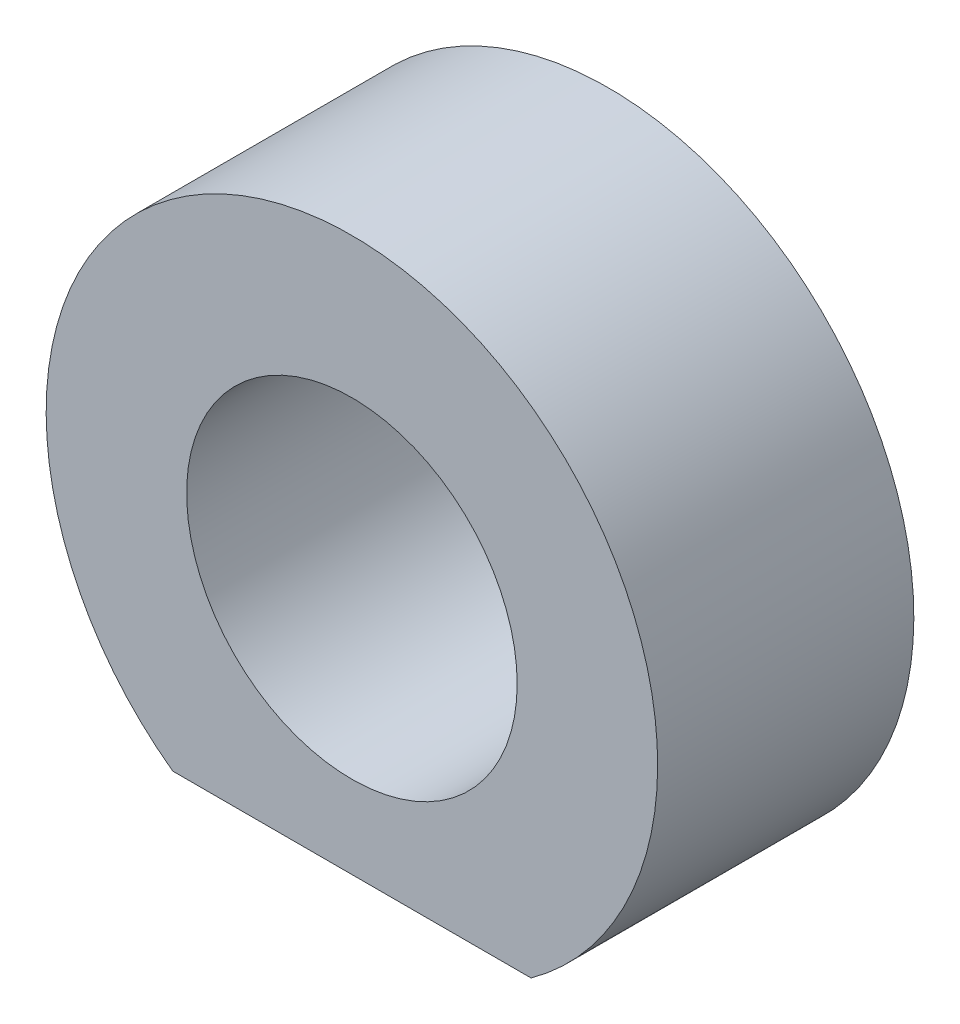
ISO-10303-21;
HEADER;
FILE_DESCRIPTION(('STEP AP214'),'2;1');
FILE_NAME('part.step','',(''),(''),'','','');
FILE_SCHEMA(('AUTOMOTIVE_DESIGN { 1 0 10303 214 1 1 1 1 }'));
ENDSEC;
DATA;
#1=APPLICATION_CONTEXT('core data for automotive mechanical design processes');
#2=APPLICATION_PROTOCOL_DEFINITION('international standard','automotive_design',2000,#1);
#3=PRODUCT_CONTEXT('',#1,'mechanical');
#4=PRODUCT('Part','Part','',(#3));
#5=PRODUCT_RELATED_PRODUCT_CATEGORY('part','',(#4));
#6=PRODUCT_DEFINITION_FORMATION('','',#4);
#7=PRODUCT_DEFINITION_CONTEXT('part definition',#1,'design');
#8=PRODUCT_DEFINITION('design','',#6,#7);
#9=PRODUCT_DEFINITION_SHAPE('','',#8);
#10=(LENGTH_UNIT() NAMED_UNIT(*) SI_UNIT(.MILLI.,.METRE.));
#11=(NAMED_UNIT(*) PLANE_ANGLE_UNIT() SI_UNIT($,.RADIAN.));
#12=(NAMED_UNIT(*) SI_UNIT($,.STERADIAN.) SOLID_ANGLE_UNIT());
#13=UNCERTAINTY_MEASURE_WITH_UNIT(LENGTH_MEASURE(1.E-05),#10,'distance_accuracy_value','');
#14=(GEOMETRIC_REPRESENTATION_CONTEXT(3) GLOBAL_UNCERTAINTY_ASSIGNED_CONTEXT((#13)) GLOBAL_UNIT_ASSIGNED_CONTEXT((#10,
#11,#12)) REPRESENTATION_CONTEXT('',''));
#15=CARTESIAN_POINT('',(0.,0.,0.));
#16=DIRECTION('',(0.,0.,1.));
#17=DIRECTION('',(1.,0.,0.));
#18=AXIS2_PLACEMENT_3D('',#15,#16,#17);
#19=CARTESIAN_POINT('',(0.,0.,15.5));
#20=DIRECTION('',(0.,0.,1.));
#21=DIRECTION('',(1.,0.,0.));
#22=AXIS2_PLACEMENT_3D('',#19,#20,#21);
#23=PLANE('',#22);
#24=CARTESIAN_POINT('',(0.,0.,15.5));
#25=DIRECTION('',(0.,0.,1.));
#26=DIRECTION('',(1.,0.,0.));
#27=AXIS2_PLACEMENT_3D('',#24,#25,#26);
#28=CIRCLE('',#27,18.5);
#29=CARTESIAN_POINT('',(10.84,-14.9914775789446,15.5));
#30=VERTEX_POINT('',#29);
#31=CARTESIAN_POINT('',(-10.84,-14.9914775789446,15.5));
#32=VERTEX_POINT('',#31);
#33=EDGE_CURVE('E95',#30,#32,#28,.T.);
#34=ORIENTED_EDGE('',*,*,#33,.T.);
#35=DIRECTION('',(1.,0.,0.));
#36=VECTOR('',#35,1.);
#37=CARTESIAN_POINT('',(-10.84,-14.9914775789446,15.5));
#38=LINE('',#37,#36);
#39=EDGE_CURVE('E56',#32,#30,#38,.T.);
#40=ORIENTED_EDGE('',*,*,#39,.T.);
#41=EDGE_LOOP('',(#34,#40));
#42=FACE_BOUND('',#41,.T.);
#43=CARTESIAN_POINT('',(0.,0.,15.5));
#44=DIRECTION('',(0.,0.,1.));
#45=DIRECTION('',(1.,0.,0.));
#46=AXIS2_PLACEMENT_3D('',#43,#44,#45);
#47=CIRCLE('',#46,10.);
#48=CARTESIAN_POINT('',(10.,0.,15.5));
#49=VERTEX_POINT('',#48);
#50=EDGE_CURVE('E86',#49,#49,#47,.T.);
#51=ORIENTED_EDGE('',*,*,#50,.F.);
#52=EDGE_LOOP('',(#51));
#53=FACE_BOUND('',#52,.T.);
#54=ADVANCED_FACE('F39',(#42,#53),#23,.T.);
#55=CARTESIAN_POINT('',(0.,0.,0.));
#56=DIRECTION('',(0.,0.,1.));
#57=DIRECTION('',(1.,0.,0.));
#58=AXIS2_PLACEMENT_3D('',#55,#56,#57);
#59=PLANE('',#58);
#60=CARTESIAN_POINT('',(0.,0.,0.));
#61=DIRECTION('',(0.,0.,1.));
#62=DIRECTION('',(1.,0.,0.));
#63=AXIS2_PLACEMENT_3D('',#60,#61,#62);
#64=CIRCLE('',#63,18.5);
#65=CARTESIAN_POINT('',(10.84,-14.9914775789446,0.));
#66=VERTEX_POINT('',#65);
#67=CARTESIAN_POINT('',(-10.84,-14.9914775789446,0.));
#68=VERTEX_POINT('',#67);
#69=EDGE_CURVE('E93',#66,#68,#64,.T.);
#70=ORIENTED_EDGE('',*,*,#69,.F.);
#71=DIRECTION('',(1.,0.,0.));
#72=VECTOR('',#71,1.);
#73=CARTESIAN_POINT('',(-10.84,-14.9914775789446,0.));
#74=LINE('',#73,#72);
#75=EDGE_CURVE('E66',#68,#66,#74,.T.);
#76=ORIENTED_EDGE('',*,*,#75,.F.);
#77=EDGE_LOOP('',(#70,#76));
#78=FACE_BOUND('',#77,.T.);
#79=CARTESIAN_POINT('',(0.,0.,0.));
#80=DIRECTION('',(0.,0.,1.));
#81=DIRECTION('',(1.,0.,0.));
#82=AXIS2_PLACEMENT_3D('',#79,#80,#81);
#83=CIRCLE('',#82,10.);
#84=CARTESIAN_POINT('',(10.,0.,0.));
#85=VERTEX_POINT('',#84);
#86=EDGE_CURVE('E80',#85,#85,#83,.T.);
#87=ORIENTED_EDGE('',*,*,#86,.T.);
#88=EDGE_LOOP('',(#87));
#89=FACE_BOUND('',#88,.T.);
#90=ADVANCED_FACE('F110',(#78,#89),#59,.F.);
#91=CARTESIAN_POINT('',(0.,0.,15.5));
#92=DIRECTION('',(0.,0.,-1.));
#93=DIRECTION('',(-1.,0.,0.));
#94=AXIS2_PLACEMENT_3D('',#91,#92,#93);
#95=CYLINDRICAL_SURFACE('',#94,18.5);
#96=ORIENTED_EDGE('',*,*,#69,.T.);
#97=DIRECTION('',(0.,0.,-1.));
#98=VECTOR('',#97,1.);
#99=CARTESIAN_POINT('',(-10.84,-14.9914775789446,15.5));
#100=LINE('',#99,#98);
#101=EDGE_CURVE('E11',#32,#68,#100,.T.);
#102=ORIENTED_EDGE('',*,*,#101,.F.);
#103=ORIENTED_EDGE('',*,*,#33,.F.);
#104=DIRECTION('',(0.,0.,-1.));
#105=VECTOR('',#104,1.);
#106=CARTESIAN_POINT('',(10.84,-14.9914775789446,15.5));
#107=LINE('',#106,#105);
#108=EDGE_CURVE('E49',#30,#66,#107,.T.);
#109=ORIENTED_EDGE('',*,*,#108,.T.);
#110=EDGE_LOOP('',(#96,#102,#103,#109));
#111=FACE_BOUND('',#110,.T.);
#112=ADVANCED_FACE('F41',(#111),#95,.T.);
#113=CARTESIAN_POINT('',(-10.84,-14.9914775789446,15.5));
#114=DIRECTION('',(0.,1.,0.));
#115=DIRECTION('',(0.,0.,1.));
#116=AXIS2_PLACEMENT_3D('',#113,#114,#115);
#117=PLANE('',#116);
#118=CARTESIAN_POINT('',(0.,-14.9914775789446,7.75));
#119=DIRECTION('',(0.,-1.,0.));
#120=DIRECTION('',(0.,0.,-1.));
#121=AXIS2_PLACEMENT_3D('',#118,#119,#120);
#122=CIRCLE('',#121,1.);
#123=CARTESIAN_POINT('',(0.,-14.9914775789446,6.75));
#124=VERTEX_POINT('',#123);
#125=EDGE_CURVE('E81',#124,#124,#122,.T.);
#126=ORIENTED_EDGE('',*,*,#125,.F.);
#127=EDGE_LOOP('',(#126));
#128=FACE_BOUND('',#127,.T.);
#129=ORIENTED_EDGE('',*,*,#75,.T.);
#130=ORIENTED_EDGE('',*,*,#108,.F.);
#131=ORIENTED_EDGE('',*,*,#39,.F.);
#132=ORIENTED_EDGE('',*,*,#101,.T.);
#133=EDGE_LOOP('',(#129,#130,#131,#132));
#134=FACE_BOUND('',#133,.T.);
#135=ADVANCED_FACE('F117',(#128,#134),#117,.F.);
#136=CARTESIAN_POINT('',(0.,0.,15.5));
#137=DIRECTION('',(0.,0.,-1.));
#138=DIRECTION('',(-1.,0.,0.));
#139=AXIS2_PLACEMENT_3D('',#136,#137,#138);
#140=CYLINDRICAL_SURFACE('',#139,10.);
#141=ORIENTED_EDGE('',*,*,#50,.T.);
#142=EDGE_LOOP('',(#141));
#143=FACE_BOUND('',#142,.T.);
#144=ORIENTED_EDGE('',*,*,#86,.F.);
#145=EDGE_LOOP('',(#144));
#146=FACE_BOUND('',#145,.T.);
#147=ADVANCED_FACE('F73',(#143,#146),#140,.F.);
#148=CARTESIAN_POINT('',(0.,-12.9914775789446,7.75));
#149=DIRECTION('',(0.,-1.,0.));
#150=DIRECTION('',(0.,0.,-1.));
#151=AXIS2_PLACEMENT_3D('',#148,#149,#150);
#152=CONICAL_SURFACE('',#151,0.999999999999999,1.02974425867665);
#153=CARTESIAN_POINT('',(0.,-12.3906169599171,7.75));
#154=VERTEX_POINT('',#153);
#155=VERTEX_LOOP('',#154);
#156=FACE_BOUND('',#155,.T.);
#157=CARTESIAN_POINT('',(0.,-12.9914775789446,7.75));
#158=DIRECTION('',(0.,-1.,0.));
#159=DIRECTION('',(0.,0.,-1.));
#160=AXIS2_PLACEMENT_3D('',#157,#158,#159);
#161=CIRCLE('',#160,0.999999999999999);
#162=CARTESIAN_POINT('',(0.,-12.9914775789446,6.75));
#163=VERTEX_POINT('',#162);
#164=EDGE_CURVE('E77',#163,#163,#161,.T.);
#165=ORIENTED_EDGE('',*,*,#164,.T.);
#166=EDGE_LOOP('',(#165));
#167=FACE_BOUND('',#166,.T.);
#168=ADVANCED_FACE('F69',(#156,#167),#152,.F.);
#169=CARTESIAN_POINT('',(0.,-14.9914775789446,7.75));
#170=DIRECTION('',(0.,-1.,0.));
#171=DIRECTION('',(0.,0.,-1.));
#172=AXIS2_PLACEMENT_3D('',#169,#170,#171);
#173=CYLINDRICAL_SURFACE('',#172,1.);
#174=ORIENTED_EDGE('',*,*,#164,.F.);
#175=EDGE_LOOP('',(#174));
#176=FACE_BOUND('',#175,.T.);
#177=ORIENTED_EDGE('',*,*,#125,.T.);
#178=EDGE_LOOP('',(#177));
#179=FACE_BOUND('',#178,.T.);
#180=ADVANCED_FACE('F72',(#176,#179),#173,.F.);
#181=CLOSED_SHELL('',(#54,#90,#112,#135,#147,#168,#180));
#182=MANIFOLD_SOLID_BREP('B2',#181);
#183=ADVANCED_BREP_SHAPE_REPRESENTATION('',(#18,#182),#14);
#184=SHAPE_DEFINITION_REPRESENTATION(#9,#183);
ENDSEC;
END-ISO-10303-21;
